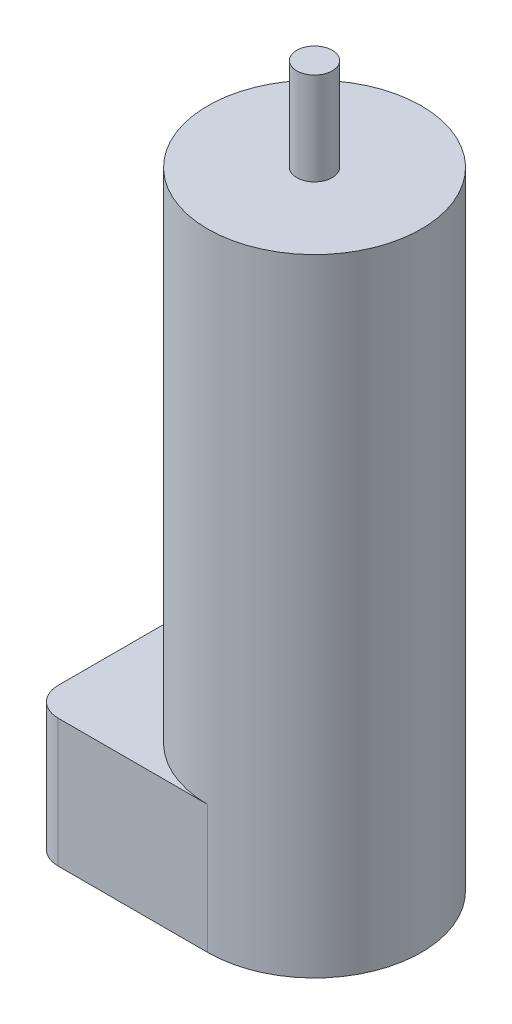
ISO-10303-21;
HEADER;
FILE_DESCRIPTION(('STEP AP214'),'2;1');
FILE_NAME('part.step','',(''),(''),'','','');
FILE_SCHEMA(('AUTOMOTIVE_DESIGN { 1 0 10303 214 1 1 1 1 }'));
ENDSEC;
DATA;
#1=APPLICATION_CONTEXT('core data for automotive mechanical design processes');
#2=APPLICATION_PROTOCOL_DEFINITION('international standard','automotive_design',2000,#1);
#3=PRODUCT_CONTEXT('',#1,'mechanical');
#4=PRODUCT('Part','Part','',(#3));
#5=PRODUCT_RELATED_PRODUCT_CATEGORY('part','',(#4));
#6=PRODUCT_DEFINITION_FORMATION('','',#4);
#7=PRODUCT_DEFINITION_CONTEXT('part definition',#1,'design');
#8=PRODUCT_DEFINITION('design','',#6,#7);
#9=PRODUCT_DEFINITION_SHAPE('','',#8);
#10=(LENGTH_UNIT() NAMED_UNIT(*) SI_UNIT(.MILLI.,.METRE.));
#11=(NAMED_UNIT(*) PLANE_ANGLE_UNIT() SI_UNIT($,.RADIAN.));
#12=(NAMED_UNIT(*) SI_UNIT($,.STERADIAN.) SOLID_ANGLE_UNIT());
#13=UNCERTAINTY_MEASURE_WITH_UNIT(LENGTH_MEASURE(1.E-05),#10,'distance_accuracy_value','');
#14=(GEOMETRIC_REPRESENTATION_CONTEXT(3) GLOBAL_UNCERTAINTY_ASSIGNED_CONTEXT((#13)) GLOBAL_UNIT_ASSIGNED_CONTEXT((#10,
#11,#12)) REPRESENTATION_CONTEXT('',''));
#15=CARTESIAN_POINT('',(0.,0.,0.));
#16=DIRECTION('',(0.,0.,1.));
#17=DIRECTION('',(1.,0.,0.));
#18=AXIS2_PLACEMENT_3D('',#15,#16,#17);
#19=CARTESIAN_POINT('',(0.,88.,0.));
#20=DIRECTION('',(0.,-1.,0.));
#21=DIRECTION('',(0.,0.,-1.));
#22=AXIS2_PLACEMENT_3D('',#19,#20,#21);
#23=CYLINDRICAL_SURFACE('',#22,15.);
#24=CARTESIAN_POINT('',(0.,88.,0.));
#25=DIRECTION('',(0.,1.,0.));
#26=DIRECTION('',(0.,0.,1.));
#27=AXIS2_PLACEMENT_3D('',#24,#25,#26);
#28=CIRCLE('',#27,15.);
#29=CARTESIAN_POINT('',(0.,88.,15.));
#30=VERTEX_POINT('',#29);
#31=EDGE_CURVE('E115',#30,#30,#28,.T.);
#32=ORIENTED_EDGE('',*,*,#31,.F.);
#33=EDGE_LOOP('',(#32));
#34=FACE_BOUND('',#33,.T.);
#35=CARTESIAN_POINT('',(0.,18.,0.));
#36=DIRECTION('',(0.,-1.,0.));
#37=DIRECTION('',(0.,0.,-1.));
#38=AXIS2_PLACEMENT_3D('',#35,#36,#37);
#39=CIRCLE('',#38,15.);
#40=CARTESIAN_POINT('',(0.,18.,15.));
#41=VERTEX_POINT('',#40);
#42=CARTESIAN_POINT('',(0.,18.,-15.));
#43=VERTEX_POINT('',#42);
#44=EDGE_CURVE('E118',#41,#43,#39,.T.);
#45=ORIENTED_EDGE('',*,*,#44,.F.);
#46=DIRECTION('',(0.,1.,0.));
#47=VECTOR('',#46,1.);
#48=CARTESIAN_POINT('',(0.,-50.,15.));
#49=LINE('',#48,#47);
#50=CARTESIAN_POINT('',(0.,0.,15.));
#51=VERTEX_POINT('',#50);
#52=EDGE_CURVE('E101',#51,#41,#49,.T.);
#53=ORIENTED_EDGE('',*,*,#52,.F.);
#54=CARTESIAN_POINT('',(0.,0.,0.));
#55=DIRECTION('',(0.,1.,0.));
#56=DIRECTION('',(0.,0.,1.));
#57=AXIS2_PLACEMENT_3D('',#54,#55,#56);
#58=CIRCLE('',#57,15.);
#59=CARTESIAN_POINT('',(0.,0.,-15.));
#60=VERTEX_POINT('',#59);
#61=EDGE_CURVE('E108',#51,#60,#58,.T.);
#62=ORIENTED_EDGE('',*,*,#61,.T.);
#63=DIRECTION('',(0.,1.,0.));
#64=VECTOR('',#63,1.);
#65=CARTESIAN_POINT('',(0.,-50.,-15.));
#66=LINE('',#65,#64);
#67=EDGE_CURVE('E120',#60,#43,#66,.T.);
#68=ORIENTED_EDGE('',*,*,#67,.T.);
#69=EDGE_LOOP('',(#45,#53,#62,#68));
#70=FACE_BOUND('',#69,.T.);
#71=ADVANCED_FACE('F42',(#34,#70),#23,.T.);
#72=CARTESIAN_POINT('',(0.,88.,0.));
#73=DIRECTION('',(0.,1.,0.));
#74=DIRECTION('',(0.,0.,1.));
#75=AXIS2_PLACEMENT_3D('',#72,#73,#74);
#76=PLANE('',#75);
#77=CARTESIAN_POINT('',(0.,88.,0.));
#78=DIRECTION('',(0.,1.,0.));
#79=DIRECTION('',(0.,0.,1.));
#80=AXIS2_PLACEMENT_3D('',#77,#78,#79);
#81=CIRCLE('',#80,2.5);
#82=CARTESIAN_POINT('',(0.,88.,2.5));
#83=VERTEX_POINT('',#82);
#84=EDGE_CURVE('E132',#83,#83,#81,.T.);
#85=ORIENTED_EDGE('',*,*,#84,.F.);
#86=EDGE_LOOP('',(#85));
#87=FACE_BOUND('',#86,.T.);
#88=ORIENTED_EDGE('',*,*,#31,.T.);
#89=EDGE_LOOP('',(#88));
#90=FACE_BOUND('',#89,.T.);
#91=ADVANCED_FACE('F188',(#87,#90),#76,.T.);
#92=CARTESIAN_POINT('',(0.,0.,0.));
#93=DIRECTION('',(0.,1.,0.));
#94=DIRECTION('',(0.,0.,1.));
#95=AXIS2_PLACEMENT_3D('',#92,#93,#94);
#96=PLANE('',#95);
#97=DIRECTION('',(1.,0.,0.));
#98=VECTOR('',#97,1.);
#99=CARTESIAN_POINT('',(-25.,0.,15.));
#100=LINE('',#99,#98);
#101=CARTESIAN_POINT('',(-21.,0.,15.));
#102=VERTEX_POINT('',#101);
#103=EDGE_CURVE('E97',#102,#51,#100,.T.);
#104=ORIENTED_EDGE('',*,*,#103,.F.);
#105=CARTESIAN_POINT('',(-21.,0.,11.));
#106=DIRECTION('',(0.,1.,0.));
#107=DIRECTION('',(0.,0.,1.));
#108=AXIS2_PLACEMENT_3D('',#105,#106,#107);
#109=CIRCLE('',#108,4.);
#110=CARTESIAN_POINT('',(-25.,0.,11.));
#111=VERTEX_POINT('',#110);
#112=EDGE_CURVE('E51',#102,#111,#109,.F.);
#113=ORIENTED_EDGE('',*,*,#112,.T.);
#114=DIRECTION('',(0.,0.,1.));
#115=VECTOR('',#114,1.);
#116=CARTESIAN_POINT('',(-25.,0.,-15.));
#117=LINE('',#116,#115);
#118=CARTESIAN_POINT('',(-25.,0.,-11.));
#119=VERTEX_POINT('',#118);
#120=EDGE_CURVE('E106',#119,#111,#117,.T.);
#121=ORIENTED_EDGE('',*,*,#120,.F.);
#122=CARTESIAN_POINT('',(-21.,0.,-11.));
#123=DIRECTION('',(0.,1.,0.));
#124=DIRECTION('',(0.,0.,1.));
#125=AXIS2_PLACEMENT_3D('',#122,#123,#124);
#126=CIRCLE('',#125,4.);
#127=CARTESIAN_POINT('',(-21.,0.,-15.));
#128=VERTEX_POINT('',#127);
#129=EDGE_CURVE('E58',#119,#128,#126,.F.);
#130=ORIENTED_EDGE('',*,*,#129,.T.);
#131=DIRECTION('',(-1.,0.,0.));
#132=VECTOR('',#131,1.);
#133=CARTESIAN_POINT('',(0.,0.,-15.));
#134=LINE('',#133,#132);
#135=EDGE_CURVE('E110',#60,#128,#134,.T.);
#136=ORIENTED_EDGE('',*,*,#135,.F.);
#137=ORIENTED_EDGE('',*,*,#61,.F.);
#138=EDGE_LOOP('',(#104,#113,#121,#130,#136,#137));
#139=FACE_BOUND('',#138,.T.);
#140=ADVANCED_FACE('F109',(#139),#96,.F.);
#141=CARTESIAN_POINT('',(0.,101.,0.));
#142=DIRECTION('',(0.,-1.,0.));
#143=DIRECTION('',(0.,0.,-1.));
#144=AXIS2_PLACEMENT_3D('',#141,#142,#143);
#145=CYLINDRICAL_SURFACE('',#144,2.5);
#146=CARTESIAN_POINT('',(0.,101.,0.));
#147=DIRECTION('',(0.,1.,0.));
#148=DIRECTION('',(0.,0.,1.));
#149=AXIS2_PLACEMENT_3D('',#146,#147,#148);
#150=CIRCLE('',#149,2.5);
#151=CARTESIAN_POINT('',(0.,101.,2.5));
#152=VERTEX_POINT('',#151);
#153=EDGE_CURVE('E105',#152,#152,#150,.T.);
#154=ORIENTED_EDGE('',*,*,#153,.F.);
#155=EDGE_LOOP('',(#154));
#156=FACE_BOUND('',#155,.T.);
#157=ORIENTED_EDGE('',*,*,#84,.T.);
#158=EDGE_LOOP('',(#157));
#159=FACE_BOUND('',#158,.T.);
#160=ADVANCED_FACE('F199',(#156,#159),#145,.T.);
#161=CARTESIAN_POINT('',(0.,101.,0.));
#162=DIRECTION('',(0.,1.,0.));
#163=DIRECTION('',(0.,0.,1.));
#164=AXIS2_PLACEMENT_3D('',#161,#162,#163);
#165=PLANE('',#164);
#166=ORIENTED_EDGE('',*,*,#153,.T.);
#167=EDGE_LOOP('',(#166));
#168=FACE_BOUND('',#167,.T.);
#169=ADVANCED_FACE('F203',(#168),#165,.T.);
#170=CARTESIAN_POINT('',(0.,18.,0.));
#171=DIRECTION('',(0.,-1.,0.));
#172=DIRECTION('',(0.,0.,-1.));
#173=AXIS2_PLACEMENT_3D('',#170,#171,#172);
#174=PLANE('',#173);
#175=DIRECTION('',(0.,0.,-1.));
#176=VECTOR('',#175,1.);
#177=CARTESIAN_POINT('',(-25.,18.,-15.));
#178=LINE('',#177,#176);
#179=CARTESIAN_POINT('',(-25.,18.,11.));
#180=VERTEX_POINT('',#179);
#181=CARTESIAN_POINT('',(-25.,18.,-11.));
#182=VERTEX_POINT('',#181);
#183=EDGE_CURVE('E172',#180,#182,#178,.T.);
#184=ORIENTED_EDGE('',*,*,#183,.F.);
#185=CARTESIAN_POINT('',(-21.,18.,11.));
#186=DIRECTION('',(0.,-1.,0.));
#187=DIRECTION('',(0.,0.,-1.));
#188=AXIS2_PLACEMENT_3D('',#185,#186,#187);
#189=CIRCLE('',#188,4.);
#190=CARTESIAN_POINT('',(-21.,18.,15.));
#191=VERTEX_POINT('',#190);
#192=EDGE_CURVE('E151',#180,#191,#189,.F.);
#193=ORIENTED_EDGE('',*,*,#192,.T.);
#194=DIRECTION('',(-1.,0.,0.));
#195=VECTOR('',#194,1.);
#196=CARTESIAN_POINT('',(-25.,18.,15.));
#197=LINE('',#196,#195);
#198=EDGE_CURVE('E171',#41,#191,#197,.T.);
#199=ORIENTED_EDGE('',*,*,#198,.F.);
#200=ORIENTED_EDGE('',*,*,#44,.T.);
#201=DIRECTION('',(1.,0.,0.));
#202=VECTOR('',#201,1.);
#203=CARTESIAN_POINT('',(0.,18.,-15.));
#204=LINE('',#203,#202);
#205=CARTESIAN_POINT('',(-21.,18.,-15.));
#206=VERTEX_POINT('',#205);
#207=EDGE_CURVE('E125',#206,#43,#204,.T.);
#208=ORIENTED_EDGE('',*,*,#207,.F.);
#209=CARTESIAN_POINT('',(-21.,18.,-11.));
#210=DIRECTION('',(0.,-1.,0.));
#211=DIRECTION('',(0.,0.,-1.));
#212=AXIS2_PLACEMENT_3D('',#209,#210,#211);
#213=CIRCLE('',#212,4.);
#214=EDGE_CURVE('E148',#206,#182,#213,.F.);
#215=ORIENTED_EDGE('',*,*,#214,.T.);
#216=EDGE_LOOP('',(#184,#193,#199,#200,#208,#215));
#217=FACE_BOUND('',#216,.T.);
#218=ADVANCED_FACE('F170',(#217),#174,.F.);
#219=CARTESIAN_POINT('',(0.,-50.,-15.));
#220=DIRECTION('',(0.,0.,1.));
#221=DIRECTION('',(1.,0.,0.));
#222=AXIS2_PLACEMENT_3D('',#219,#220,#221);
#223=PLANE('',#222);
#224=ORIENTED_EDGE('',*,*,#135,.T.);
#225=DIRECTION('',(0.,1.,0.));
#226=VECTOR('',#225,1.);
#227=CARTESIAN_POINT('',(-21.,-50.,-15.));
#228=LINE('',#227,#226);
#229=EDGE_CURVE('E11',#128,#206,#228,.T.);
#230=ORIENTED_EDGE('',*,*,#229,.T.);
#231=ORIENTED_EDGE('',*,*,#207,.T.);
#232=ORIENTED_EDGE('',*,*,#67,.F.);
#233=EDGE_LOOP('',(#224,#230,#231,#232));
#234=FACE_BOUND('',#233,.T.);
#235=ADVANCED_FACE('F180',(#234),#223,.F.);
#236=CARTESIAN_POINT('',(-25.,-50.,-15.));
#237=DIRECTION('',(1.,0.,0.));
#238=DIRECTION('',(0.,0.,-1.));
#239=AXIS2_PLACEMENT_3D('',#236,#237,#238);
#240=PLANE('',#239);
#241=ORIENTED_EDGE('',*,*,#120,.T.);
#242=DIRECTION('',(0.,1.,0.));
#243=VECTOR('',#242,1.);
#244=CARTESIAN_POINT('',(-25.,-50.,11.));
#245=LINE('',#244,#243);
#246=EDGE_CURVE('E144',#111,#180,#245,.T.);
#247=ORIENTED_EDGE('',*,*,#246,.T.);
#248=ORIENTED_EDGE('',*,*,#183,.T.);
#249=DIRECTION('',(0.,1.,0.));
#250=VECTOR('',#249,1.);
#251=CARTESIAN_POINT('',(-25.,-50.,-11.));
#252=LINE('',#251,#250);
#253=EDGE_CURVE('E141',#182,#119,#252,.F.);
#254=ORIENTED_EDGE('',*,*,#253,.T.);
#255=EDGE_LOOP('',(#241,#247,#248,#254));
#256=FACE_BOUND('',#255,.T.);
#257=ADVANCED_FACE('F162',(#256),#240,.F.);
#258=CARTESIAN_POINT('',(-25.,-50.,15.));
#259=DIRECTION('',(0.,0.,-1.));
#260=DIRECTION('',(-1.,0.,0.));
#261=AXIS2_PLACEMENT_3D('',#258,#259,#260);
#262=PLANE('',#261);
#263=ORIENTED_EDGE('',*,*,#198,.T.);
#264=DIRECTION('',(0.,1.,0.));
#265=VECTOR('',#264,1.);
#266=CARTESIAN_POINT('',(-21.,-50.,15.));
#267=LINE('',#266,#265);
#268=EDGE_CURVE('E66',#191,#102,#267,.F.);
#269=ORIENTED_EDGE('',*,*,#268,.T.);
#270=ORIENTED_EDGE('',*,*,#103,.T.);
#271=ORIENTED_EDGE('',*,*,#52,.T.);
#272=EDGE_LOOP('',(#263,#269,#270,#271));
#273=FACE_BOUND('',#272,.T.);
#274=ADVANCED_FACE('F99',(#273),#262,.F.);
#275=CARTESIAN_POINT('',(-21.,-50.,11.));
#276=DIRECTION('',(0.,1.,0.));
#277=DIRECTION('',(0.,0.,1.));
#278=AXIS2_PLACEMENT_3D('',#275,#276,#277);
#279=CYLINDRICAL_SURFACE('',#278,4.);
#280=ORIENTED_EDGE('',*,*,#112,.F.);
#281=ORIENTED_EDGE('',*,*,#268,.F.);
#282=ORIENTED_EDGE('',*,*,#192,.F.);
#283=ORIENTED_EDGE('',*,*,#246,.F.);
#284=EDGE_LOOP('',(#280,#281,#282,#283));
#285=FACE_BOUND('',#284,.T.);
#286=ADVANCED_FACE('F168',(#285),#279,.T.);
#287=CARTESIAN_POINT('',(-21.,-50.,-11.));
#288=DIRECTION('',(0.,1.,0.));
#289=DIRECTION('',(0.,0.,1.));
#290=AXIS2_PLACEMENT_3D('',#287,#288,#289);
#291=CYLINDRICAL_SURFACE('',#290,4.);
#292=ORIENTED_EDGE('',*,*,#129,.F.);
#293=ORIENTED_EDGE('',*,*,#253,.F.);
#294=ORIENTED_EDGE('',*,*,#214,.F.);
#295=ORIENTED_EDGE('',*,*,#229,.F.);
#296=EDGE_LOOP('',(#292,#293,#294,#295));
#297=FACE_BOUND('',#296,.T.);
#298=ADVANCED_FACE('F44',(#297),#291,.T.);
#299=CLOSED_SHELL('',(#71,#91,#140,#160,#169,#218,#235,#257,#274,#286,#298));
#300=MANIFOLD_SOLID_BREP('B2',#299);
#301=ADVANCED_BREP_SHAPE_REPRESENTATION('',(#18,#300),#14);
#302=SHAPE_DEFINITION_REPRESENTATION(#9,#301);
ENDSEC;
END-ISO-10303-21;
